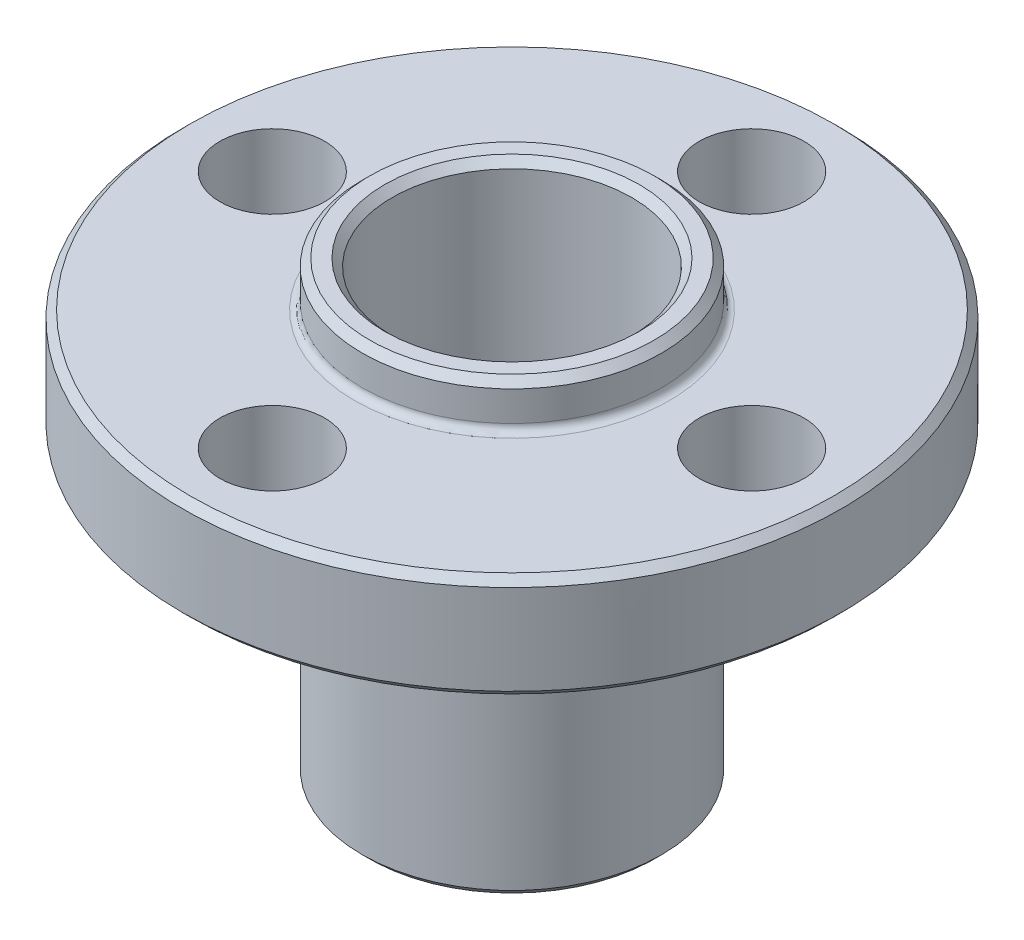
ISO-10303-21;
HEADER;
FILE_DESCRIPTION(('STEP AP214'),'2;1');
FILE_NAME('part.step','',(''),(''),'','','');
FILE_SCHEMA(('AUTOMOTIVE_DESIGN { 1 0 10303 214 1 1 1 1 }'));
ENDSEC;
DATA;
#1=APPLICATION_CONTEXT('core data for automotive mechanical design processes');
#2=APPLICATION_PROTOCOL_DEFINITION('international standard','automotive_design',2000,#1);
#3=PRODUCT_CONTEXT('',#1,'mechanical');
#4=PRODUCT('Part','Part','',(#3));
#5=PRODUCT_RELATED_PRODUCT_CATEGORY('part','',(#4));
#6=PRODUCT_DEFINITION_FORMATION('','',#4);
#7=PRODUCT_DEFINITION_CONTEXT('part definition',#1,'design');
#8=PRODUCT_DEFINITION('design','',#6,#7);
#9=PRODUCT_DEFINITION_SHAPE('','',#8);
#10=(LENGTH_UNIT() NAMED_UNIT(*) SI_UNIT(.MILLI.,.METRE.));
#11=(NAMED_UNIT(*) PLANE_ANGLE_UNIT() SI_UNIT($,.RADIAN.));
#12=(NAMED_UNIT(*) SI_UNIT($,.STERADIAN.) SOLID_ANGLE_UNIT());
#13=UNCERTAINTY_MEASURE_WITH_UNIT(LENGTH_MEASURE(1.E-05),#10,'distance_accuracy_value','');
#14=(GEOMETRIC_REPRESENTATION_CONTEXT(3) GLOBAL_UNCERTAINTY_ASSIGNED_CONTEXT((#13)) GLOBAL_UNIT_ASSIGNED_CONTEXT((#10,
#11,#12)) REPRESENTATION_CONTEXT('',''));
#15=CARTESIAN_POINT('',(0.,0.,0.));
#16=DIRECTION('',(0.,0.,1.));
#17=DIRECTION('',(1.,0.,0.));
#18=AXIS2_PLACEMENT_3D('',#15,#16,#17);
#19=CARTESIAN_POINT('',(0.,15.,0.));
#20=DIRECTION('',(0.,-1.,0.));
#21=DIRECTION('',(0.,0.,-1.));
#22=AXIS2_PLACEMENT_3D('',#19,#20,#21);
#23=PLANE('',#22);
#24=CARTESIAN_POINT('',(-4.,15.,0.));
#25=DIRECTION('',(0.,-1.,0.));
#26=DIRECTION('',(0.,0.,-1.));
#27=AXIS2_PLACEMENT_3D('',#24,#25,#26);
#28=CIRCLE('',#27,4.25);
#29=CARTESIAN_POINT('',(-4.,15.,-4.25));
#30=VERTEX_POINT('',#29);
#31=EDGE_CURVE('E97',#30,#30,#28,.T.);
#32=ORIENTED_EDGE('',*,*,#31,.T.);
#33=EDGE_LOOP('',(#32));
#34=FACE_BOUND('',#33,.T.);
#35=CARTESIAN_POINT('',(-4.,15.,0.));
#36=DIRECTION('',(0.,-1.,0.));
#37=DIRECTION('',(0.,0.,-1.));
#38=AXIS2_PLACEMENT_3D('',#35,#36,#37);
#39=CIRCLE('',#38,4.74999999999999);
#40=CARTESIAN_POINT('',(-4.,15.,-4.74999999999999));
#41=VERTEX_POINT('',#40);
#42=EDGE_CURVE('E101',#41,#41,#39,.F.);
#43=ORIENTED_EDGE('',*,*,#42,.T.);
#44=EDGE_LOOP('',(#43));
#45=FACE_BOUND('',#44,.T.);
#46=ADVANCED_FACE('F41',(#34,#45),#23,.F.);
#47=CARTESIAN_POINT('',(-4.,0.,0.));
#48=DIRECTION('',(0.,-1.,0.));
#49=DIRECTION('',(0.,0.,-1.));
#50=AXIS2_PLACEMENT_3D('',#47,#48,#49);
#51=CYLINDRICAL_SURFACE('',#50,5.);
#52=CARTESIAN_POINT('',(-4.,13.75,0.));
#53=DIRECTION('',(0.,-1.,0.));
#54=DIRECTION('',(0.,0.,-1.));
#55=AXIS2_PLACEMENT_3D('',#52,#53,#54);
#56=CIRCLE('',#55,5.);
#57=CARTESIAN_POINT('',(-4.,13.75,-5.));
#58=VERTEX_POINT('',#57);
#59=EDGE_CURVE('E54',#58,#58,#56,.F.);
#60=ORIENTED_EDGE('',*,*,#59,.T.);
#61=EDGE_LOOP('',(#60));
#62=FACE_BOUND('',#61,.T.);
#63=CARTESIAN_POINT('',(-4.,14.75,0.));
#64=DIRECTION('',(0.,-1.,0.));
#65=DIRECTION('',(0.,0.,-1.));
#66=AXIS2_PLACEMENT_3D('',#63,#64,#65);
#67=CIRCLE('',#66,5.);
#68=CARTESIAN_POINT('',(-4.,14.75,-5.));
#69=VERTEX_POINT('',#68);
#70=EDGE_CURVE('E89',#69,#69,#67,.T.);
#71=ORIENTED_EDGE('',*,*,#70,.T.);
#72=EDGE_LOOP('',(#71));
#73=FACE_BOUND('',#72,.T.);
#74=ADVANCED_FACE('F178',(#62,#73),#51,.T.);
#75=CARTESIAN_POINT('',(-4.,0.,0.));
#76=DIRECTION('',(0.,-1.,0.));
#77=DIRECTION('',(0.,0.,-1.));
#78=AXIS2_PLACEMENT_3D('',#75,#76,#77);
#79=CYLINDRICAL_SURFACE('',#78,4.);
#80=CARTESIAN_POINT('',(-4.,14.75,0.));
#81=DIRECTION('',(0.,-1.,0.));
#82=DIRECTION('',(0.,0.,-1.));
#83=AXIS2_PLACEMENT_3D('',#80,#81,#82);
#84=CIRCLE('',#83,4.);
#85=CARTESIAN_POINT('',(-4.,14.75,-4.));
#86=VERTEX_POINT('',#85);
#87=EDGE_CURVE('E93',#86,#86,#84,.F.);
#88=ORIENTED_EDGE('',*,*,#87,.T.);
#89=EDGE_LOOP('',(#88));
#90=FACE_BOUND('',#89,.T.);
#91=CARTESIAN_POINT('',(-4.,0.,0.));
#92=DIRECTION('',(0.,-1.,0.));
#93=DIRECTION('',(0.,0.,-1.));
#94=AXIS2_PLACEMENT_3D('',#91,#92,#93);
#95=CIRCLE('',#94,4.);
#96=CARTESIAN_POINT('',(-4.,0.,-4.));
#97=VERTEX_POINT('',#96);
#98=EDGE_CURVE('E105',#97,#97,#95,.T.);
#99=ORIENTED_EDGE('',*,*,#98,.T.);
#100=EDGE_LOOP('',(#99));
#101=FACE_BOUND('',#100,.T.);
#102=ADVANCED_FACE('F149',(#90,#101),#79,.F.);
#103=CARTESIAN_POINT('',(0.,13.5,0.));
#104=DIRECTION('',(0.,-1.,0.));
#105=DIRECTION('',(0.,0.,-1.));
#106=AXIS2_PLACEMENT_3D('',#103,#104,#105);
#107=PLANE('',#106);
#108=CARTESIAN_POINT('',(-4.,13.5,0.));
#109=DIRECTION('',(0.,-1.,0.));
#110=DIRECTION('',(0.,0.,-1.));
#111=AXIS2_PLACEMENT_3D('',#108,#109,#110);
#112=CIRCLE('',#111,5.25);
#113=CARTESIAN_POINT('',(-4.,13.5,-5.25));
#114=VERTEX_POINT('',#113);
#115=EDGE_CURVE('E59',#114,#114,#112,.T.);
#116=ORIENTED_EDGE('',*,*,#115,.T.);
#117=EDGE_LOOP('',(#116));
#118=FACE_BOUND('',#117,.T.);
#119=CARTESIAN_POINT('',(-4.,13.5,0.));
#120=DIRECTION('',(0.,-1.,0.));
#121=DIRECTION('',(0.,0.,-1.));
#122=AXIS2_PLACEMENT_3D('',#119,#120,#121);
#123=CIRCLE('',#122,10.75);
#124=CARTESIAN_POINT('',(-4.,13.5,-10.75));
#125=VERTEX_POINT('',#124);
#126=EDGE_CURVE('E65',#125,#125,#123,.F.);
#127=ORIENTED_EDGE('',*,*,#126,.T.);
#128=EDGE_LOOP('',(#127));
#129=FACE_BOUND('',#128,.T.);
#130=CARTESIAN_POINT('',(-4.,13.5,8.));
#131=DIRECTION('',(0.,1.,0.));
#132=DIRECTION('',(0.,0.,1.));
#133=AXIS2_PLACEMENT_3D('',#130,#131,#132);
#134=CIRCLE('',#133,1.75);
#135=CARTESIAN_POINT('',(-4.,13.5,9.75));
#136=VERTEX_POINT('',#135);
#137=EDGE_CURVE('E122',#136,#136,#134,.T.);
#138=ORIENTED_EDGE('',*,*,#137,.F.);
#139=EDGE_LOOP('',(#138));
#140=FACE_BOUND('',#139,.T.);
#141=CARTESIAN_POINT('',(-12.,13.5,0.));
#142=DIRECTION('',(0.,1.,0.));
#143=DIRECTION('',(0.,0.,1.));
#144=AXIS2_PLACEMENT_3D('',#141,#142,#143);
#145=CIRCLE('',#144,1.75);
#146=CARTESIAN_POINT('',(-12.,13.5,1.75));
#147=VERTEX_POINT('',#146);
#148=EDGE_CURVE('E134',#147,#147,#145,.T.);
#149=ORIENTED_EDGE('',*,*,#148,.F.);
#150=EDGE_LOOP('',(#149));
#151=FACE_BOUND('',#150,.T.);
#152=CARTESIAN_POINT('',(-4.,13.5,-8.));
#153=DIRECTION('',(0.,1.,0.));
#154=DIRECTION('',(0.,0.,1.));
#155=AXIS2_PLACEMENT_3D('',#152,#153,#154);
#156=CIRCLE('',#155,1.75);
#157=CARTESIAN_POINT('',(-4.,13.5,-6.25));
#158=VERTEX_POINT('',#157);
#159=EDGE_CURVE('E130',#158,#158,#156,.T.);
#160=ORIENTED_EDGE('',*,*,#159,.F.);
#161=EDGE_LOOP('',(#160));
#162=FACE_BOUND('',#161,.T.);
#163=CARTESIAN_POINT('',(4.,13.5,0.));
#164=DIRECTION('',(0.,1.,0.));
#165=DIRECTION('',(0.,0.,1.));
#166=AXIS2_PLACEMENT_3D('',#163,#164,#165);
#167=CIRCLE('',#166,1.75);
#168=CARTESIAN_POINT('',(4.,13.5,1.75));
#169=VERTEX_POINT('',#168);
#170=EDGE_CURVE('E126',#169,#169,#167,.T.);
#171=ORIENTED_EDGE('',*,*,#170,.F.);
#172=EDGE_LOOP('',(#171));
#173=FACE_BOUND('',#172,.T.);
#174=ADVANCED_FACE('F145',(#118,#129,#140,#151,#162,#173),#107,.F.);
#175=CARTESIAN_POINT('',(-4.,0.,0.));
#176=DIRECTION('',(0.,-1.,0.));
#177=DIRECTION('',(0.,0.,-1.));
#178=AXIS2_PLACEMENT_3D('',#175,#176,#177);
#179=CYLINDRICAL_SURFACE('',#178,11.);
#180=CARTESIAN_POINT('',(-4.,10.25,0.));
#181=DIRECTION('',(0.,1.,0.));
#182=DIRECTION('',(0.,0.,1.));
#183=AXIS2_PLACEMENT_3D('',#180,#181,#182);
#184=CIRCLE('',#183,11.);
#185=CARTESIAN_POINT('',(-4.,10.25,11.));
#186=VERTEX_POINT('',#185);
#187=EDGE_CURVE('E69',#186,#186,#184,.T.);
#188=ORIENTED_EDGE('',*,*,#187,.T.);
#189=EDGE_LOOP('',(#188));
#190=FACE_BOUND('',#189,.T.);
#191=CARTESIAN_POINT('',(-4.,13.25,0.));
#192=DIRECTION('',(0.,-1.,0.));
#193=DIRECTION('',(0.,0.,-1.));
#194=AXIS2_PLACEMENT_3D('',#191,#192,#193);
#195=CIRCLE('',#194,11.);
#196=CARTESIAN_POINT('',(-4.,13.25,-11.));
#197=VERTEX_POINT('',#196);
#198=EDGE_CURVE('E73',#197,#197,#195,.T.);
#199=ORIENTED_EDGE('',*,*,#198,.T.);
#200=EDGE_LOOP('',(#199));
#201=FACE_BOUND('',#200,.T.);
#202=ADVANCED_FACE('F148',(#190,#201),#179,.T.);
#203=CARTESIAN_POINT('',(0.,10.,0.));
#204=DIRECTION('',(0.,1.,0.));
#205=DIRECTION('',(0.,0.,1.));
#206=AXIS2_PLACEMENT_3D('',#203,#204,#205);
#207=PLANE('',#206);
#208=CARTESIAN_POINT('',(-4.,10.,0.));
#209=DIRECTION('',(0.,1.,0.));
#210=DIRECTION('',(0.,0.,1.));
#211=AXIS2_PLACEMENT_3D('',#208,#209,#210);
#212=CIRCLE('',#211,5.25);
#213=CARTESIAN_POINT('',(-4.,10.,5.25));
#214=VERTEX_POINT('',#213);
#215=EDGE_CURVE('E10',#214,#214,#212,.T.);
#216=ORIENTED_EDGE('',*,*,#215,.T.);
#217=EDGE_LOOP('',(#216));
#218=FACE_BOUND('',#217,.T.);
#219=CARTESIAN_POINT('',(-4.,10.,0.));
#220=DIRECTION('',(0.,1.,0.));
#221=DIRECTION('',(0.,0.,1.));
#222=AXIS2_PLACEMENT_3D('',#219,#220,#221);
#223=CIRCLE('',#222,10.75);
#224=CARTESIAN_POINT('',(-4.,10.,10.75));
#225=VERTEX_POINT('',#224);
#226=EDGE_CURVE('E77',#225,#225,#223,.F.);
#227=ORIENTED_EDGE('',*,*,#226,.T.);
#228=EDGE_LOOP('',(#227));
#229=FACE_BOUND('',#228,.T.);
#230=CARTESIAN_POINT('',(-4.,10.,8.));
#231=DIRECTION('',(0.,1.,0.));
#232=DIRECTION('',(0.,0.,1.));
#233=AXIS2_PLACEMENT_3D('',#230,#231,#232);
#234=CIRCLE('',#233,1.75);
#235=CARTESIAN_POINT('',(-4.,10.,9.75));
#236=VERTEX_POINT('',#235);
#237=EDGE_CURVE('E106',#236,#236,#234,.T.);
#238=ORIENTED_EDGE('',*,*,#237,.T.);
#239=EDGE_LOOP('',(#238));
#240=FACE_BOUND('',#239,.T.);
#241=CARTESIAN_POINT('',(-12.,10.,0.));
#242=DIRECTION('',(0.,1.,0.));
#243=DIRECTION('',(0.,0.,1.));
#244=AXIS2_PLACEMENT_3D('',#241,#242,#243);
#245=CIRCLE('',#244,1.75);
#246=CARTESIAN_POINT('',(-12.,10.,1.75));
#247=VERTEX_POINT('',#246);
#248=EDGE_CURVE('E110',#247,#247,#245,.T.);
#249=ORIENTED_EDGE('',*,*,#248,.T.);
#250=EDGE_LOOP('',(#249));
#251=FACE_BOUND('',#250,.T.);
#252=CARTESIAN_POINT('',(-4.,10.,-8.));
#253=DIRECTION('',(0.,1.,0.));
#254=DIRECTION('',(0.,0.,1.));
#255=AXIS2_PLACEMENT_3D('',#252,#253,#254);
#256=CIRCLE('',#255,1.75);
#257=CARTESIAN_POINT('',(-4.,10.,-6.25));
#258=VERTEX_POINT('',#257);
#259=EDGE_CURVE('E114',#258,#258,#256,.T.);
#260=ORIENTED_EDGE('',*,*,#259,.T.);
#261=EDGE_LOOP('',(#260));
#262=FACE_BOUND('',#261,.T.);
#263=CARTESIAN_POINT('',(4.,10.,0.));
#264=DIRECTION('',(0.,1.,0.));
#265=DIRECTION('',(0.,0.,1.));
#266=AXIS2_PLACEMENT_3D('',#263,#264,#265);
#267=CIRCLE('',#266,1.75);
#268=CARTESIAN_POINT('',(4.,10.,1.75));
#269=VERTEX_POINT('',#268);
#270=EDGE_CURVE('E118',#269,#269,#267,.T.);
#271=ORIENTED_EDGE('',*,*,#270,.T.);
#272=EDGE_LOOP('',(#271));
#273=FACE_BOUND('',#272,.T.);
#274=ADVANCED_FACE('F166',(#218,#229,#240,#251,#262,#273),#207,.F.);
#275=CARTESIAN_POINT('',(-4.,0.,0.));
#276=DIRECTION('',(0.,-1.,0.));
#277=DIRECTION('',(0.,0.,-1.));
#278=AXIS2_PLACEMENT_3D('',#275,#276,#277);
#279=CYLINDRICAL_SURFACE('',#278,5.);
#280=CARTESIAN_POINT('',(-4.,9.75,0.));
#281=DIRECTION('',(0.,1.,0.));
#282=DIRECTION('',(0.,0.,1.));
#283=AXIS2_PLACEMENT_3D('',#280,#281,#282);
#284=CIRCLE('',#283,5.);
#285=CARTESIAN_POINT('',(-4.,9.75,5.));
#286=VERTEX_POINT('',#285);
#287=EDGE_CURVE('E49',#286,#286,#284,.F.);
#288=ORIENTED_EDGE('',*,*,#287,.T.);
#289=EDGE_LOOP('',(#288));
#290=FACE_BOUND('',#289,.T.);
#291=CARTESIAN_POINT('',(-4.,0.249999999999996,0.));
#292=DIRECTION('',(0.,-1.,0.));
#293=DIRECTION('',(0.,0.,-1.));
#294=AXIS2_PLACEMENT_3D('',#291,#292,#293);
#295=CIRCLE('',#294,5.);
#296=CARTESIAN_POINT('',(-4.,0.249999999999996,-5.));
#297=VERTEX_POINT('',#296);
#298=EDGE_CURVE('E81',#297,#297,#295,.F.);
#299=ORIENTED_EDGE('',*,*,#298,.T.);
#300=EDGE_LOOP('',(#299));
#301=FACE_BOUND('',#300,.T.);
#302=ADVANCED_FACE('F168',(#290,#301),#279,.T.);
#303=CARTESIAN_POINT('',(0.,0.,0.));
#304=DIRECTION('',(0.,-1.,0.));
#305=DIRECTION('',(0.,0.,-1.));
#306=AXIS2_PLACEMENT_3D('',#303,#304,#305);
#307=PLANE('',#306);
#308=CARTESIAN_POINT('',(-4.,0.,0.));
#309=DIRECTION('',(0.,-1.,0.));
#310=DIRECTION('',(0.,0.,-1.));
#311=AXIS2_PLACEMENT_3D('',#308,#309,#310);
#312=CIRCLE('',#311,4.75);
#313=CARTESIAN_POINT('',(-4.,0.,-4.75));
#314=VERTEX_POINT('',#313);
#315=EDGE_CURVE('E85',#314,#314,#312,.T.);
#316=ORIENTED_EDGE('',*,*,#315,.T.);
#317=EDGE_LOOP('',(#316));
#318=FACE_BOUND('',#317,.T.);
#319=ORIENTED_EDGE('',*,*,#98,.F.);
#320=EDGE_LOOP('',(#319));
#321=FACE_BOUND('',#320,.T.);
#322=ADVANCED_FACE('F162',(#318,#321),#307,.T.);
#323=CARTESIAN_POINT('',(4.,3.5,0.));
#324=DIRECTION('',(0.,1.,0.));
#325=DIRECTION('',(0.,0.,1.));
#326=AXIS2_PLACEMENT_3D('',#323,#324,#325);
#327=CYLINDRICAL_SURFACE('',#326,1.75);
#328=ORIENTED_EDGE('',*,*,#170,.T.);
#329=EDGE_LOOP('',(#328));
#330=FACE_BOUND('',#329,.T.);
#331=ORIENTED_EDGE('',*,*,#270,.F.);
#332=EDGE_LOOP('',(#331));
#333=FACE_BOUND('',#332,.T.);
#334=ADVANCED_FACE('F158',(#330,#333),#327,.F.);
#335=CARTESIAN_POINT('',(-4.,3.5,-8.));
#336=DIRECTION('',(0.,1.,0.));
#337=DIRECTION('',(0.,0.,1.));
#338=AXIS2_PLACEMENT_3D('',#335,#336,#337);
#339=CYLINDRICAL_SURFACE('',#338,1.75);
#340=ORIENTED_EDGE('',*,*,#159,.T.);
#341=EDGE_LOOP('',(#340));
#342=FACE_BOUND('',#341,.T.);
#343=ORIENTED_EDGE('',*,*,#259,.F.);
#344=EDGE_LOOP('',(#343));
#345=FACE_BOUND('',#344,.T.);
#346=ADVANCED_FACE('F161',(#342,#345),#339,.F.);
#347=CARTESIAN_POINT('',(-12.,3.5,0.));
#348=DIRECTION('',(0.,1.,0.));
#349=DIRECTION('',(0.,0.,1.));
#350=AXIS2_PLACEMENT_3D('',#347,#348,#349);
#351=CYLINDRICAL_SURFACE('',#350,1.75);
#352=ORIENTED_EDGE('',*,*,#148,.T.);
#353=EDGE_LOOP('',(#352));
#354=FACE_BOUND('',#353,.T.);
#355=ORIENTED_EDGE('',*,*,#248,.F.);
#356=EDGE_LOOP('',(#355));
#357=FACE_BOUND('',#356,.T.);
#358=ADVANCED_FACE('F194',(#354,#357),#351,.F.);
#359=CARTESIAN_POINT('',(-4.,3.5,8.));
#360=DIRECTION('',(0.,1.,0.));
#361=DIRECTION('',(0.,0.,1.));
#362=AXIS2_PLACEMENT_3D('',#359,#360,#361);
#363=CYLINDRICAL_SURFACE('',#362,1.75);
#364=ORIENTED_EDGE('',*,*,#137,.T.);
#365=EDGE_LOOP('',(#364));
#366=FACE_BOUND('',#365,.T.);
#367=ORIENTED_EDGE('',*,*,#237,.F.);
#368=EDGE_LOOP('',(#367));
#369=FACE_BOUND('',#368,.T.);
#370=ADVANCED_FACE('F142',(#366,#369),#363,.F.);
#371=CARTESIAN_POINT('',(-4.,15.,0.));
#372=DIRECTION('',(0.,1.,0.));
#373=DIRECTION('',(0.,0.,1.));
#374=AXIS2_PLACEMENT_3D('',#371,#372,#373);
#375=CONICAL_SURFACE('',#374,4.25,0.785398163397448);
#376=ORIENTED_EDGE('',*,*,#87,.F.);
#377=EDGE_LOOP('',(#376));
#378=FACE_BOUND('',#377,.T.);
#379=ORIENTED_EDGE('',*,*,#31,.F.);
#380=EDGE_LOOP('',(#379));
#381=FACE_BOUND('',#380,.T.);
#382=ADVANCED_FACE('F200',(#378,#381),#375,.F.);
#383=CARTESIAN_POINT('',(-4.,14.75,0.));
#384=DIRECTION('',(0.,-1.,0.));
#385=DIRECTION('',(0.,0.,-1.));
#386=AXIS2_PLACEMENT_3D('',#383,#384,#385);
#387=CONICAL_SURFACE('',#386,5.,0.785398163397448);
#388=ORIENTED_EDGE('',*,*,#42,.F.);
#389=EDGE_LOOP('',(#388));
#390=FACE_BOUND('',#389,.T.);
#391=ORIENTED_EDGE('',*,*,#70,.F.);
#392=EDGE_LOOP('',(#391));
#393=FACE_BOUND('',#392,.T.);
#394=ADVANCED_FACE('F204',(#390,#393),#387,.T.);
#395=CARTESIAN_POINT('',(-4.,0.,0.));
#396=DIRECTION('',(0.,1.,0.));
#397=DIRECTION('',(0.,0.,1.));
#398=AXIS2_PLACEMENT_3D('',#395,#396,#397);
#399=CONICAL_SURFACE('',#398,4.75,0.785398163397448);
#400=ORIENTED_EDGE('',*,*,#298,.F.);
#401=EDGE_LOOP('',(#400));
#402=FACE_BOUND('',#401,.T.);
#403=ORIENTED_EDGE('',*,*,#315,.F.);
#404=EDGE_LOOP('',(#403));
#405=FACE_BOUND('',#404,.T.);
#406=ADVANCED_FACE('F210',(#402,#405),#399,.T.);
#407=CARTESIAN_POINT('',(-4.,10.,0.));
#408=DIRECTION('',(0.,1.,0.));
#409=DIRECTION('',(0.,0.,1.));
#410=AXIS2_PLACEMENT_3D('',#407,#408,#409);
#411=CONICAL_SURFACE('',#410,10.75,0.785398163397448);
#412=ORIENTED_EDGE('',*,*,#187,.F.);
#413=EDGE_LOOP('',(#412));
#414=FACE_BOUND('',#413,.T.);
#415=ORIENTED_EDGE('',*,*,#226,.F.);
#416=EDGE_LOOP('',(#415));
#417=FACE_BOUND('',#416,.T.);
#418=ADVANCED_FACE('F229',(#414,#417),#411,.T.);
#419=CARTESIAN_POINT('',(-4.,13.25,0.));
#420=DIRECTION('',(0.,-1.,0.));
#421=DIRECTION('',(0.,0.,-1.));
#422=AXIS2_PLACEMENT_3D('',#419,#420,#421);
#423=CONICAL_SURFACE('',#422,11.,0.785398163397452);
#424=ORIENTED_EDGE('',*,*,#126,.F.);
#425=EDGE_LOOP('',(#424));
#426=FACE_BOUND('',#425,.T.);
#427=ORIENTED_EDGE('',*,*,#198,.F.);
#428=EDGE_LOOP('',(#427));
#429=FACE_BOUND('',#428,.T.);
#430=ADVANCED_FACE('F236',(#426,#429),#423,.T.);
#431=CARTESIAN_POINT('',(-4.,13.75,0.));
#432=DIRECTION('',(0.,-1.,0.));
#433=DIRECTION('',(0.,0.,-1.));
#434=AXIS2_PLACEMENT_3D('',#431,#432,#433);
#435=TOROIDAL_SURFACE('',#434,5.25,0.25);
#436=ORIENTED_EDGE('',*,*,#59,.F.);
#437=EDGE_LOOP('',(#436));
#438=FACE_BOUND('',#437,.T.);
#439=ORIENTED_EDGE('',*,*,#115,.F.);
#440=EDGE_LOOP('',(#439));
#441=FACE_BOUND('',#440,.T.);
#442=ADVANCED_FACE('F241',(#438,#441),#435,.F.);
#443=CARTESIAN_POINT('',(-4.,9.75,0.));
#444=DIRECTION('',(0.,1.,0.));
#445=DIRECTION('',(0.,0.,1.));
#446=AXIS2_PLACEMENT_3D('',#443,#444,#445);
#447=TOROIDAL_SURFACE('',#446,5.25,0.25);
#448=ORIENTED_EDGE('',*,*,#215,.F.);
#449=EDGE_LOOP('',(#448));
#450=FACE_BOUND('',#449,.T.);
#451=ORIENTED_EDGE('',*,*,#287,.F.);
#452=EDGE_LOOP('',(#451));
#453=FACE_BOUND('',#452,.T.);
#454=ADVANCED_FACE('F43',(#450,#453),#447,.F.);
#455=CLOSED_SHELL('',(#46,#74,#102,#174,#202,#274,#302,#322,#334,#346,#358,#370,#382,#394,#406,
#418,#430,#442,#454));
#456=MANIFOLD_SOLID_BREP('B2',#455);
#457=ADVANCED_BREP_SHAPE_REPRESENTATION('',(#18,#456),#14);
#458=SHAPE_DEFINITION_REPRESENTATION(#9,#457);
ENDSEC;
END-ISO-10303-21;
